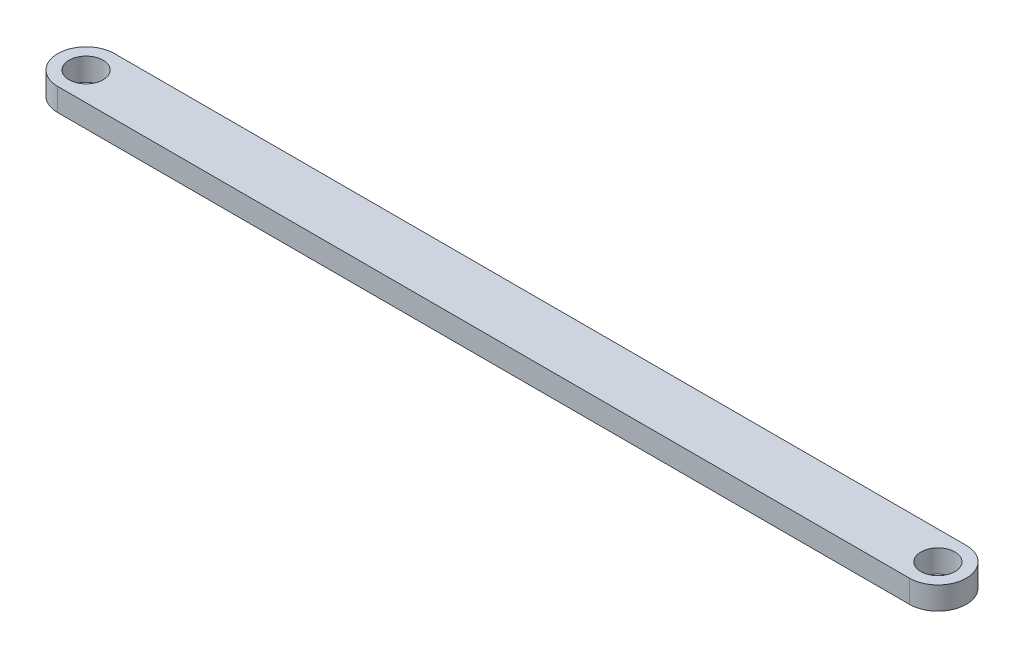
ISO-10303-21;
HEADER;
FILE_DESCRIPTION(('STEP AP214'),'2;1');
FILE_NAME('part.step','',(''),(''),'','','');
FILE_SCHEMA(('AUTOMOTIVE_DESIGN { 1 0 10303 214 1 1 1 1 }'));
ENDSEC;
DATA;
#1=APPLICATION_CONTEXT('core data for automotive mechanical design processes');
#2=APPLICATION_PROTOCOL_DEFINITION('international standard','automotive_design',2000,#1);
#3=PRODUCT_CONTEXT('',#1,'mechanical');
#4=PRODUCT('Part','Part','',(#3));
#5=PRODUCT_RELATED_PRODUCT_CATEGORY('part','',(#4));
#6=PRODUCT_DEFINITION_FORMATION('','',#4);
#7=PRODUCT_DEFINITION_CONTEXT('part definition',#1,'design');
#8=PRODUCT_DEFINITION('design','',#6,#7);
#9=PRODUCT_DEFINITION_SHAPE('','',#8);
#10=(LENGTH_UNIT() NAMED_UNIT(*) SI_UNIT(.MILLI.,.METRE.));
#11=(NAMED_UNIT(*) PLANE_ANGLE_UNIT() SI_UNIT($,.RADIAN.));
#12=(NAMED_UNIT(*) SI_UNIT($,.STERADIAN.) SOLID_ANGLE_UNIT());
#13=UNCERTAINTY_MEASURE_WITH_UNIT(LENGTH_MEASURE(1.E-05),#10,'distance_accuracy_value','');
#14=(GEOMETRIC_REPRESENTATION_CONTEXT(3) GLOBAL_UNCERTAINTY_ASSIGNED_CONTEXT((#13)) GLOBAL_UNIT_ASSIGNED_CONTEXT((#10,
#11,#12)) REPRESENTATION_CONTEXT('',''));
#15=CARTESIAN_POINT('',(0.,0.,0.));
#16=DIRECTION('',(0.,0.,1.));
#17=DIRECTION('',(1.,0.,0.));
#18=AXIS2_PLACEMENT_3D('',#15,#16,#17);
#19=CARTESIAN_POINT('',(0.,4.,5.));
#20=DIRECTION('',(0.,0.,-1.));
#21=DIRECTION('',(-1.,0.,0.));
#22=AXIS2_PLACEMENT_3D('',#19,#20,#21);
#23=PLANE('',#22);
#24=DIRECTION('',(1.,0.,0.));
#25=VECTOR('',#24,1.);
#26=CARTESIAN_POINT('',(0.,0.,5.));
#27=LINE('',#26,#25);
#28=CARTESIAN_POINT('',(0.,0.,5.));
#29=VERTEX_POINT('',#28);
#30=CARTESIAN_POINT('',(150.,0.,4.99999999999999));
#31=VERTEX_POINT('',#30);
#32=EDGE_CURVE('E104',#29,#31,#27,.T.);
#33=ORIENTED_EDGE('',*,*,#32,.T.);
#34=DIRECTION('',(0.,-1.,0.));
#35=VECTOR('',#34,1.);
#36=CARTESIAN_POINT('',(150.,4.,4.99999999999999));
#37=LINE('',#36,#35);
#38=CARTESIAN_POINT('',(150.,4.,4.99999999999999));
#39=VERTEX_POINT('',#38);
#40=EDGE_CURVE('E11',#39,#31,#37,.T.);
#41=ORIENTED_EDGE('',*,*,#40,.F.);
#42=DIRECTION('',(1.,0.,0.));
#43=VECTOR('',#42,1.);
#44=CARTESIAN_POINT('',(0.,4.,5.));
#45=LINE('',#44,#43);
#46=CARTESIAN_POINT('',(0.,4.,5.));
#47=VERTEX_POINT('',#46);
#48=EDGE_CURVE('E83',#47,#39,#45,.T.);
#49=ORIENTED_EDGE('',*,*,#48,.F.);
#50=DIRECTION('',(0.,-1.,0.));
#51=VECTOR('',#50,1.);
#52=CARTESIAN_POINT('',(0.,4.,5.));
#53=LINE('',#52,#51);
#54=EDGE_CURVE('E103',#47,#29,#53,.T.);
#55=ORIENTED_EDGE('',*,*,#54,.T.);
#56=EDGE_LOOP('',(#33,#41,#49,#55));
#57=FACE_BOUND('',#56,.T.);
#58=ADVANCED_FACE('F35',(#57),#23,.F.);
#59=CARTESIAN_POINT('',(150.,4.,0.));
#60=DIRECTION('',(0.,-1.,0.));
#61=DIRECTION('',(0.,0.,-1.));
#62=AXIS2_PLACEMENT_3D('',#59,#60,#61);
#63=CYLINDRICAL_SURFACE('',#62,4.99999999999999);
#64=CARTESIAN_POINT('',(150.,0.,0.));
#65=DIRECTION('',(0.,1.,0.));
#66=DIRECTION('',(0.,0.,1.));
#67=AXIS2_PLACEMENT_3D('',#64,#65,#66);
#68=CIRCLE('',#67,4.99999999999999);
#69=CARTESIAN_POINT('',(150.,0.,-4.99999999999999));
#70=VERTEX_POINT('',#69);
#71=EDGE_CURVE('E88',#31,#70,#68,.T.);
#72=ORIENTED_EDGE('',*,*,#71,.T.);
#73=DIRECTION('',(0.,-1.,0.));
#74=VECTOR('',#73,1.);
#75=CARTESIAN_POINT('',(150.,4.,-4.99999999999999));
#76=LINE('',#75,#74);
#77=CARTESIAN_POINT('',(150.,4.,-4.99999999999999));
#78=VERTEX_POINT('',#77);
#79=EDGE_CURVE('E43',#78,#70,#76,.T.);
#80=ORIENTED_EDGE('',*,*,#79,.F.);
#81=CARTESIAN_POINT('',(150.,4.,0.));
#82=DIRECTION('',(0.,1.,0.));
#83=DIRECTION('',(0.,0.,1.));
#84=AXIS2_PLACEMENT_3D('',#81,#82,#83);
#85=CIRCLE('',#84,4.99999999999999);
#86=EDGE_CURVE('E77',#39,#78,#85,.T.);
#87=ORIENTED_EDGE('',*,*,#86,.F.);
#88=ORIENTED_EDGE('',*,*,#40,.T.);
#89=EDGE_LOOP('',(#72,#80,#87,#88));
#90=FACE_BOUND('',#89,.T.);
#91=ADVANCED_FACE('F87',(#90),#63,.T.);
#92=CARTESIAN_POINT('',(0.,4.,-5.));
#93=DIRECTION('',(0.,0.,-1.));
#94=DIRECTION('',(-1.,0.,0.));
#95=AXIS2_PLACEMENT_3D('',#92,#93,#94);
#96=PLANE('',#95);
#97=DIRECTION('',(1.,0.,0.));
#98=VECTOR('',#97,1.);
#99=CARTESIAN_POINT('',(0.,0.,-5.));
#100=LINE('',#99,#98);
#101=CARTESIAN_POINT('',(0.,0.,-5.));
#102=VERTEX_POINT('',#101);
#103=EDGE_CURVE('E108',#102,#70,#100,.T.);
#104=ORIENTED_EDGE('',*,*,#103,.F.);
#105=DIRECTION('',(0.,-1.,0.));
#106=VECTOR('',#105,1.);
#107=CARTESIAN_POINT('',(0.,4.,-5.));
#108=LINE('',#107,#106);
#109=CARTESIAN_POINT('',(0.,4.,-5.));
#110=VERTEX_POINT('',#109);
#111=EDGE_CURVE('E67',#110,#102,#108,.T.);
#112=ORIENTED_EDGE('',*,*,#111,.F.);
#113=DIRECTION('',(1.,0.,0.));
#114=VECTOR('',#113,1.);
#115=CARTESIAN_POINT('',(0.,4.,-5.));
#116=LINE('',#115,#114);
#117=EDGE_CURVE('E81',#110,#78,#116,.T.);
#118=ORIENTED_EDGE('',*,*,#117,.T.);
#119=ORIENTED_EDGE('',*,*,#79,.T.);
#120=EDGE_LOOP('',(#104,#112,#118,#119));
#121=FACE_BOUND('',#120,.T.);
#122=ADVANCED_FACE('F92',(#121),#96,.T.);
#123=CARTESIAN_POINT('',(0.,4.,0.));
#124=DIRECTION('',(0.,-1.,0.));
#125=DIRECTION('',(0.,0.,-1.));
#126=AXIS2_PLACEMENT_3D('',#123,#124,#125);
#127=CYLINDRICAL_SURFACE('',#126,3.);
#128=CARTESIAN_POINT('',(0.,4.,0.));
#129=DIRECTION('',(0.,1.,0.));
#130=DIRECTION('',(0.,0.,1.));
#131=AXIS2_PLACEMENT_3D('',#128,#129,#130);
#132=CIRCLE('',#131,3.);
#133=CARTESIAN_POINT('',(0.,4.,3.));
#134=VERTEX_POINT('',#133);
#135=EDGE_CURVE('E94',#134,#134,#132,.T.);
#136=ORIENTED_EDGE('',*,*,#135,.T.);
#137=EDGE_LOOP('',(#136));
#138=FACE_BOUND('',#137,.T.);
#139=CARTESIAN_POINT('',(0.,0.,0.));
#140=DIRECTION('',(0.,1.,0.));
#141=DIRECTION('',(0.,0.,1.));
#142=AXIS2_PLACEMENT_3D('',#139,#140,#141);
#143=CIRCLE('',#142,3.);
#144=CARTESIAN_POINT('',(0.,0.,3.));
#145=VERTEX_POINT('',#144);
#146=EDGE_CURVE('E111',#145,#145,#143,.T.);
#147=ORIENTED_EDGE('',*,*,#146,.F.);
#148=EDGE_LOOP('',(#147));
#149=FACE_BOUND('',#148,.T.);
#150=ADVANCED_FACE('F139',(#138,#149),#127,.F.);
#151=CARTESIAN_POINT('',(0.,4.,0.));
#152=DIRECTION('',(0.,-1.,0.));
#153=DIRECTION('',(0.,0.,-1.));
#154=AXIS2_PLACEMENT_3D('',#151,#152,#153);
#155=CYLINDRICAL_SURFACE('',#154,5.);
#156=CARTESIAN_POINT('',(0.,0.,0.));
#157=DIRECTION('',(0.,1.,0.));
#158=DIRECTION('',(0.,0.,1.));
#159=AXIS2_PLACEMENT_3D('',#156,#157,#158);
#160=CIRCLE('',#159,5.);
#161=EDGE_CURVE('E70',#102,#29,#160,.T.);
#162=ORIENTED_EDGE('',*,*,#161,.T.);
#163=ORIENTED_EDGE('',*,*,#54,.F.);
#164=CARTESIAN_POINT('',(0.,4.,0.));
#165=DIRECTION('',(0.,1.,0.));
#166=DIRECTION('',(0.,0.,1.));
#167=AXIS2_PLACEMENT_3D('',#164,#165,#166);
#168=CIRCLE('',#167,5.);
#169=EDGE_CURVE('E51',#110,#47,#168,.T.);
#170=ORIENTED_EDGE('',*,*,#169,.F.);
#171=ORIENTED_EDGE('',*,*,#111,.T.);
#172=EDGE_LOOP('',(#162,#163,#170,#171));
#173=FACE_BOUND('',#172,.T.);
#174=ADVANCED_FACE('F131',(#173),#155,.T.);
#175=CARTESIAN_POINT('',(150.,4.,0.));
#176=DIRECTION('',(0.,-1.,0.));
#177=DIRECTION('',(0.,0.,-1.));
#178=AXIS2_PLACEMENT_3D('',#175,#176,#177);
#179=CYLINDRICAL_SURFACE('',#178,2.99999999999999);
#180=CARTESIAN_POINT('',(150.,4.,0.));
#181=DIRECTION('',(0.,1.,0.));
#182=DIRECTION('',(0.,0.,1.));
#183=AXIS2_PLACEMENT_3D('',#180,#181,#182);
#184=CIRCLE('',#183,2.99999999999999);
#185=CARTESIAN_POINT('',(150.,4.,2.99999999999999));
#186=VERTEX_POINT('',#185);
#187=EDGE_CURVE('E100',#186,#186,#184,.T.);
#188=ORIENTED_EDGE('',*,*,#187,.T.);
#189=EDGE_LOOP('',(#188));
#190=FACE_BOUND('',#189,.T.);
#191=CARTESIAN_POINT('',(150.,0.,0.));
#192=DIRECTION('',(0.,1.,0.));
#193=DIRECTION('',(0.,0.,1.));
#194=AXIS2_PLACEMENT_3D('',#191,#192,#193);
#195=CIRCLE('',#194,2.99999999999999);
#196=CARTESIAN_POINT('',(150.,0.,2.99999999999999));
#197=VERTEX_POINT('',#196);
#198=EDGE_CURVE('E114',#197,#197,#195,.T.);
#199=ORIENTED_EDGE('',*,*,#198,.F.);
#200=EDGE_LOOP('',(#199));
#201=FACE_BOUND('',#200,.T.);
#202=ADVANCED_FACE('F129',(#190,#201),#179,.F.);
#203=CARTESIAN_POINT('',(0.,4.,0.));
#204=DIRECTION('',(0.,1.,0.));
#205=DIRECTION('',(0.,0.,1.));
#206=AXIS2_PLACEMENT_3D('',#203,#204,#205);
#207=PLANE('',#206);
#208=ORIENTED_EDGE('',*,*,#48,.T.);
#209=ORIENTED_EDGE('',*,*,#86,.T.);
#210=ORIENTED_EDGE('',*,*,#117,.F.);
#211=ORIENTED_EDGE('',*,*,#169,.T.);
#212=EDGE_LOOP('',(#208,#209,#210,#211));
#213=FACE_BOUND('',#212,.T.);
#214=ORIENTED_EDGE('',*,*,#135,.F.);
#215=EDGE_LOOP('',(#214));
#216=FACE_BOUND('',#215,.T.);
#217=ORIENTED_EDGE('',*,*,#187,.F.);
#218=EDGE_LOOP('',(#217));
#219=FACE_BOUND('',#218,.T.);
#220=ADVANCED_FACE('F78',(#213,#216,#219),#207,.T.);
#221=CARTESIAN_POINT('',(0.,0.,0.));
#222=DIRECTION('',(0.,1.,0.));
#223=DIRECTION('',(0.,0.,1.));
#224=AXIS2_PLACEMENT_3D('',#221,#222,#223);
#225=PLANE('',#224);
#226=ORIENTED_EDGE('',*,*,#32,.F.);
#227=ORIENTED_EDGE('',*,*,#161,.F.);
#228=ORIENTED_EDGE('',*,*,#103,.T.);
#229=ORIENTED_EDGE('',*,*,#71,.F.);
#230=EDGE_LOOP('',(#226,#227,#228,#229));
#231=FACE_BOUND('',#230,.T.);
#232=ORIENTED_EDGE('',*,*,#146,.T.);
#233=EDGE_LOOP('',(#232));
#234=FACE_BOUND('',#233,.T.);
#235=ORIENTED_EDGE('',*,*,#198,.T.);
#236=EDGE_LOOP('',(#235));
#237=FACE_BOUND('',#236,.T.);
#238=ADVANCED_FACE('F121',(#231,#234,#237),#225,.F.);
#239=CLOSED_SHELL('',(#58,#91,#122,#150,#174,#202,#220,#238));
#240=MANIFOLD_SOLID_BREP('B2',#239);
#241=ADVANCED_BREP_SHAPE_REPRESENTATION('',(#18,#240),#14);
#242=SHAPE_DEFINITION_REPRESENTATION(#9,#241);
ENDSEC;
END-ISO-10303-21;
